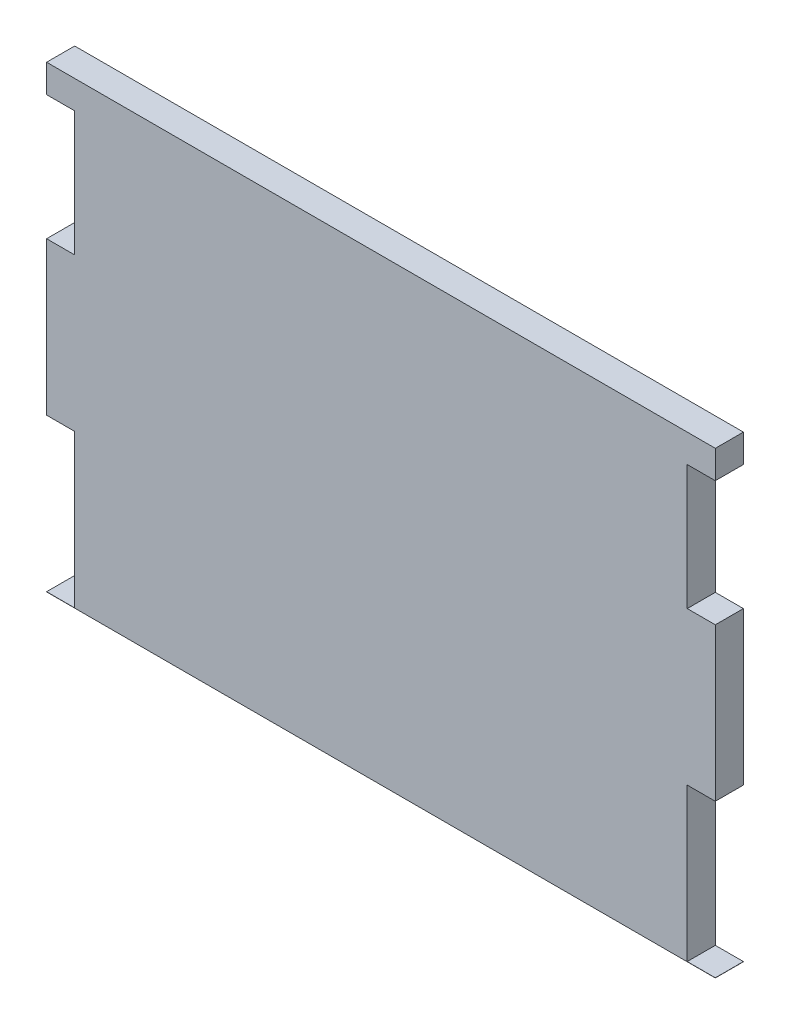
ISO-10303-21;
HEADER;
FILE_DESCRIPTION(('STEP AP214'),'2;1');
FILE_NAME('part.step','',(''),(''),'','','');
FILE_SCHEMA(('AUTOMOTIVE_DESIGN { 1 0 10303 214 1 1 1 1 }'));
ENDSEC;
DATA;
#1=APPLICATION_CONTEXT('core data for automotive mechanical design processes');
#2=APPLICATION_PROTOCOL_DEFINITION('international standard','automotive_design',2000,#1);
#3=PRODUCT_CONTEXT('',#1,'mechanical');
#4=PRODUCT('Part','Part','',(#3));
#5=PRODUCT_RELATED_PRODUCT_CATEGORY('part','',(#4));
#6=PRODUCT_DEFINITION_FORMATION('','',#4);
#7=PRODUCT_DEFINITION_CONTEXT('part definition',#1,'design');
#8=PRODUCT_DEFINITION('design','',#6,#7);
#9=PRODUCT_DEFINITION_SHAPE('','',#8);
#10=(LENGTH_UNIT() NAMED_UNIT(*) SI_UNIT(.MILLI.,.METRE.));
#11=(NAMED_UNIT(*) PLANE_ANGLE_UNIT() SI_UNIT($,.RADIAN.));
#12=(NAMED_UNIT(*) SI_UNIT($,.STERADIAN.) SOLID_ANGLE_UNIT());
#13=UNCERTAINTY_MEASURE_WITH_UNIT(LENGTH_MEASURE(1.E-05),#10,'distance_accuracy_value','');
#14=(GEOMETRIC_REPRESENTATION_CONTEXT(3) GLOBAL_UNCERTAINTY_ASSIGNED_CONTEXT((#13)) GLOBAL_UNIT_ASSIGNED_CONTEXT((#10,
#11,#12)) REPRESENTATION_CONTEXT('',''));
#15=CARTESIAN_POINT('',(0.,0.,0.));
#16=DIRECTION('',(0.,0.,1.));
#17=DIRECTION('',(1.,0.,0.));
#18=AXIS2_PLACEMENT_3D('',#15,#16,#17);
#19=CARTESIAN_POINT('',(63.5,76.2,5.334));
#20=DIRECTION('',(0.,0.,-1.));
#21=DIRECTION('',(-1.,0.,0.));
#22=AXIS2_PLACEMENT_3D('',#19,#20,#21);
#23=PLANE('',#22);
#24=DIRECTION('',(0.,1.,0.));
#25=VECTOR('',#24,1.);
#26=CARTESIAN_POINT('',(-58.166,76.2,5.334));
#27=LINE('',#26,#25);
#28=CARTESIAN_POINT('',(-58.166,-76.1637142857143,5.334));
#29=VERTEX_POINT('',#28);
#30=CARTESIAN_POINT('',(-58.166,-47.1351428571429,5.334));
#31=VERTEX_POINT('',#30);
#32=EDGE_CURVE('E504',#29,#31,#27,.T.);
#33=ORIENTED_EDGE('',*,*,#32,.F.);
#34=DIRECTION('',(1.,0.,0.));
#35=VECTOR('',#34,1.);
#36=CARTESIAN_POINT('',(-63.5,-76.1637142857143,5.334));
#37=LINE('',#36,#35);
#38=CARTESIAN_POINT('',(-63.5,-76.1637142857143,5.334));
#39=VERTEX_POINT('',#38);
#40=EDGE_CURVE('E522',#39,#29,#37,.T.);
#41=ORIENTED_EDGE('',*,*,#40,.F.);
#42=DIRECTION('',(0.,-1.,0.));
#43=VECTOR('',#42,1.);
#44=CARTESIAN_POINT('',(-63.5,-76.2,5.334));
#45=LINE('',#44,#43);
#46=CARTESIAN_POINT('',(-63.5,-76.2,5.334));
#47=VERTEX_POINT('',#46);
#48=EDGE_CURVE('E234',#39,#47,#45,.T.);
#49=ORIENTED_EDGE('',*,*,#48,.T.);
#50=DIRECTION('',(1.,0.,0.));
#51=VECTOR('',#50,1.);
#52=CARTESIAN_POINT('',(-63.5,-76.2,5.334));
#53=LINE('',#52,#51);
#54=CARTESIAN_POINT('',(63.5,-76.2,5.334));
#55=VERTEX_POINT('',#54);
#56=EDGE_CURVE('E237',#47,#55,#53,.T.);
#57=ORIENTED_EDGE('',*,*,#56,.T.);
#58=DIRECTION('',(0.,1.,0.));
#59=VECTOR('',#58,1.);
#60=CARTESIAN_POINT('',(63.5,-76.2,5.334));
#61=LINE('',#60,#59);
#62=CARTESIAN_POINT('',(63.5,-76.1637142857143,5.334));
#63=VERTEX_POINT('',#62);
#64=EDGE_CURVE('E231',#55,#63,#61,.T.);
#65=ORIENTED_EDGE('',*,*,#64,.T.);
#66=DIRECTION('',(-1.,0.,0.));
#67=VECTOR('',#66,1.);
#68=CARTESIAN_POINT('',(63.5,-76.1637142857143,5.334));
#69=LINE('',#68,#67);
#70=CARTESIAN_POINT('',(58.166,-76.1637142857143,5.334));
#71=VERTEX_POINT('',#70);
#72=EDGE_CURVE('E253',#63,#71,#69,.T.);
#73=ORIENTED_EDGE('',*,*,#72,.T.);
#74=DIRECTION('',(0.,-1.,0.));
#75=VECTOR('',#74,1.);
#76=CARTESIAN_POINT('',(58.1660000000001,76.2,5.334));
#77=LINE('',#76,#75);
#78=CARTESIAN_POINT('',(58.166,-47.1351428571429,5.334));
#79=VERTEX_POINT('',#78);
#80=EDGE_CURVE('E267',#79,#71,#77,.T.);
#81=ORIENTED_EDGE('',*,*,#80,.F.);
#82=DIRECTION('',(-1.,0.,0.));
#83=VECTOR('',#82,1.);
#84=CARTESIAN_POINT('',(63.5,-47.1351428571429,5.334));
#85=LINE('',#84,#83);
#86=CARTESIAN_POINT('',(63.5,-47.1351428571429,5.33399999999999));
#87=VERTEX_POINT('',#86);
#88=EDGE_CURVE('E293',#87,#79,#85,.T.);
#89=ORIENTED_EDGE('',*,*,#88,.F.);
#90=CARTESIAN_POINT('',(63.5,-18.1065714285714,5.334));
#91=VERTEX_POINT('',#90);
#92=EDGE_CURVE('E235',#87,#91,#61,.T.);
#93=ORIENTED_EDGE('',*,*,#92,.T.);
#94=DIRECTION('',(-1.,0.,0.));
#95=VECTOR('',#94,1.);
#96=CARTESIAN_POINT('',(63.5,-18.1065714285714,5.334));
#97=LINE('',#96,#95);
#98=CARTESIAN_POINT('',(58.166,-18.1065714285714,5.334));
#99=VERTEX_POINT('',#98);
#100=EDGE_CURVE('E282',#91,#99,#97,.T.);
#101=ORIENTED_EDGE('',*,*,#100,.T.);
#102=CARTESIAN_POINT('',(58.166,5.58800000000056,5.334));
#103=VERTEX_POINT('',#102);
#104=EDGE_CURVE('E268',#103,#99,#77,.T.);
#105=ORIENTED_EDGE('',*,*,#104,.F.);
#106=DIRECTION('',(-1.,0.,0.));
#107=VECTOR('',#106,1.);
#108=CARTESIAN_POINT('',(63.5,5.58800000000056,5.334));
#109=LINE('',#108,#107);
#110=CARTESIAN_POINT('',(63.5000000000001,5.58800000000056,5.334));
#111=VERTEX_POINT('',#110);
#112=EDGE_CURVE('E265',#111,#103,#109,.T.);
#113=ORIENTED_EDGE('',*,*,#112,.F.);
#114=CARTESIAN_POINT('',(63.5,10.922,5.334));
#115=VERTEX_POINT('',#114);
#116=EDGE_CURVE('E198',#111,#115,#61,.T.);
#117=ORIENTED_EDGE('',*,*,#116,.T.);
#118=DIRECTION('',(1.,0.,0.));
#119=VECTOR('',#118,1.);
#120=CARTESIAN_POINT('',(-63.5,10.922,5.334));
#121=LINE('',#120,#119);
#122=CARTESIAN_POINT('',(-63.5,10.922,5.334));
#123=VERTEX_POINT('',#122);
#124=EDGE_CURVE('E228',#123,#115,#121,.T.);
#125=ORIENTED_EDGE('',*,*,#124,.F.);
#126=CARTESIAN_POINT('',(-63.5,5.58800000000051,5.334));
#127=VERTEX_POINT('',#126);
#128=EDGE_CURVE('E236',#123,#127,#45,.T.);
#129=ORIENTED_EDGE('',*,*,#128,.T.);
#130=DIRECTION('',(-1.,0.,0.));
#131=VECTOR('',#130,1.);
#132=CARTESIAN_POINT('',(63.5,5.58800000000054,5.334));
#133=LINE('',#132,#131);
#134=CARTESIAN_POINT('',(-58.166,5.58800000000054,5.334));
#135=VERTEX_POINT('',#134);
#136=EDGE_CURVE('E56',#135,#127,#133,.T.);
#137=ORIENTED_EDGE('',*,*,#136,.F.);
#138=CARTESIAN_POINT('',(-58.166,-18.1065714285714,5.334));
#139=VERTEX_POINT('',#138);
#140=EDGE_CURVE('E528',#139,#135,#27,.T.);
#141=ORIENTED_EDGE('',*,*,#140,.F.);
#142=DIRECTION('',(1.,0.,0.));
#143=VECTOR('',#142,1.);
#144=CARTESIAN_POINT('',(-63.5,-18.1065714285714,5.334));
#145=LINE('',#144,#143);
#146=CARTESIAN_POINT('',(-63.5,-18.1065714285714,5.334));
#147=VERTEX_POINT('',#146);
#148=EDGE_CURVE('E508',#147,#139,#145,.T.);
#149=ORIENTED_EDGE('',*,*,#148,.F.);
#150=CARTESIAN_POINT('',(-63.5,-47.1351428571429,5.334));
#151=VERTEX_POINT('',#150);
#152=EDGE_CURVE('E238',#147,#151,#45,.T.);
#153=ORIENTED_EDGE('',*,*,#152,.T.);
#154=DIRECTION('',(1.,0.,0.));
#155=VECTOR('',#154,1.);
#156=CARTESIAN_POINT('',(-63.5,-47.1351428571429,5.334));
#157=LINE('',#156,#155);
#158=EDGE_CURVE('E48',#151,#31,#157,.T.);
#159=ORIENTED_EDGE('',*,*,#158,.T.);
#160=EDGE_LOOP('',(#33,#41,#49,#57,#65,#73,#81,#89,#93,#101,#105,#113,#117,#125,#129,#137,#141,
#149,#153,#159));
#161=FACE_BOUND('',#160,.T.);
#162=ADVANCED_FACE('F33',(#161),#23,.F.);
#163=CARTESIAN_POINT('',(63.5,76.2,0.));
#164=DIRECTION('',(0.,0.,-1.));
#165=DIRECTION('',(-1.,0.,0.));
#166=AXIS2_PLACEMENT_3D('',#163,#164,#165);
#167=PLANE('',#166);
#168=DIRECTION('',(0.,-1.,0.));
#169=VECTOR('',#168,1.);
#170=CARTESIAN_POINT('',(-63.5,-76.2,0.));
#171=LINE('',#170,#169);
#172=CARTESIAN_POINT('',(-63.5,-76.1637142857143,0.));
#173=VERTEX_POINT('',#172);
#174=CARTESIAN_POINT('',(-63.5,-76.2,0.));
#175=VERTEX_POINT('',#174);
#176=EDGE_CURVE('E197',#173,#175,#171,.T.);
#177=ORIENTED_EDGE('',*,*,#176,.F.);
#178=DIRECTION('',(1.,0.,0.));
#179=VECTOR('',#178,1.);
#180=CARTESIAN_POINT('',(-63.5,-76.1637142857143,0.));
#181=LINE('',#180,#179);
#182=CARTESIAN_POINT('',(-58.166,-76.1637142857143,0.));
#183=VERTEX_POINT('',#182);
#184=EDGE_CURVE('E520',#173,#183,#181,.T.);
#185=ORIENTED_EDGE('',*,*,#184,.T.);
#186=DIRECTION('',(0.,1.,0.));
#187=VECTOR('',#186,1.);
#188=CARTESIAN_POINT('',(-58.166,-134.220857142857,0.));
#189=LINE('',#188,#187);
#190=CARTESIAN_POINT('',(-58.166,-47.1351428571429,0.));
#191=VERTEX_POINT('',#190);
#192=EDGE_CURVE('E527',#183,#191,#189,.T.);
#193=ORIENTED_EDGE('',*,*,#192,.T.);
#194=DIRECTION('',(1.,0.,0.));
#195=VECTOR('',#194,1.);
#196=CARTESIAN_POINT('',(-63.5,-47.1351428571429,0.));
#197=LINE('',#196,#195);
#198=CARTESIAN_POINT('',(-63.5,-47.1351428571429,0.));
#199=VERTEX_POINT('',#198);
#200=EDGE_CURVE('E497',#199,#191,#197,.T.);
#201=ORIENTED_EDGE('',*,*,#200,.F.);
#202=CARTESIAN_POINT('',(-63.5,-18.1065714285715,0.));
#203=VERTEX_POINT('',#202);
#204=EDGE_CURVE('E195',#203,#199,#171,.T.);
#205=ORIENTED_EDGE('',*,*,#204,.F.);
#206=DIRECTION('',(1.,0.,0.));
#207=VECTOR('',#206,1.);
#208=CARTESIAN_POINT('',(-63.5,-18.1065714285715,0.));
#209=LINE('',#208,#207);
#210=CARTESIAN_POINT('',(-58.166,-18.1065714285715,0.));
#211=VERTEX_POINT('',#210);
#212=EDGE_CURVE('E513',#203,#211,#209,.T.);
#213=ORIENTED_EDGE('',*,*,#212,.T.);
#214=CARTESIAN_POINT('',(-58.166,5.58800000000054,1.11022302462516E-13));
#215=VERTEX_POINT('',#214);
#216=EDGE_CURVE('E189',#211,#215,#189,.T.);
#217=ORIENTED_EDGE('',*,*,#216,.T.);
#218=DIRECTION('',(-1.,0.,0.));
#219=VECTOR('',#218,1.);
#220=CARTESIAN_POINT('',(-63.5,5.58800000000054,1.11022302462516E-13));
#221=LINE('',#220,#219);
#222=CARTESIAN_POINT('',(-63.5,5.58800000000054,1.11022302462516E-13));
#223=VERTEX_POINT('',#222);
#224=EDGE_CURVE('E173',#215,#223,#221,.T.);
#225=ORIENTED_EDGE('',*,*,#224,.T.);
#226=CARTESIAN_POINT('',(-63.5,10.922,0.));
#227=VERTEX_POINT('',#226);
#228=EDGE_CURVE('E186',#227,#223,#171,.T.);
#229=ORIENTED_EDGE('',*,*,#228,.F.);
#230=DIRECTION('',(1.,0.,0.));
#231=VECTOR('',#230,1.);
#232=CARTESIAN_POINT('',(-63.5,10.922,0.));
#233=LINE('',#232,#231);
#234=CARTESIAN_POINT('',(63.5,10.922,0.));
#235=VERTEX_POINT('',#234);
#236=EDGE_CURVE('E225',#227,#235,#233,.T.);
#237=ORIENTED_EDGE('',*,*,#236,.T.);
#238=DIRECTION('',(0.,1.,0.));
#239=VECTOR('',#238,1.);
#240=CARTESIAN_POINT('',(63.5,-76.2,0.));
#241=LINE('',#240,#239);
#242=CARTESIAN_POINT('',(63.5000000000001,5.58800000000056,-1.31838984174237E-13));
#243=VERTEX_POINT('',#242);
#244=EDGE_CURVE('E208',#243,#235,#241,.T.);
#245=ORIENTED_EDGE('',*,*,#244,.F.);
#246=DIRECTION('',(-1.,0.,0.));
#247=VECTOR('',#246,1.);
#248=CARTESIAN_POINT('',(63.5000000000001,5.58800000000056,-1.31838984174237E-13));
#249=LINE('',#248,#247);
#250=CARTESIAN_POINT('',(58.166,5.58800000000056,0.));
#251=VERTEX_POINT('',#250);
#252=EDGE_CURVE('E532',#243,#251,#249,.T.);
#253=ORIENTED_EDGE('',*,*,#252,.T.);
#254=DIRECTION('',(0.,-1.,0.));
#255=VECTOR('',#254,1.);
#256=CARTESIAN_POINT('',(58.166,-134.220857142857,0.));
#257=LINE('',#256,#255);
#258=CARTESIAN_POINT('',(58.166,-18.1065714285714,0.));
#259=VERTEX_POINT('',#258);
#260=EDGE_CURVE('E255',#251,#259,#257,.T.);
#261=ORIENTED_EDGE('',*,*,#260,.T.);
#262=DIRECTION('',(-1.,0.,0.));
#263=VECTOR('',#262,1.);
#264=CARTESIAN_POINT('',(63.5,-18.1065714285714,0.));
#265=LINE('',#264,#263);
#266=CARTESIAN_POINT('',(63.5,-18.1065714285714,0.));
#267=VERTEX_POINT('',#266);
#268=EDGE_CURVE('E285',#267,#259,#265,.T.);
#269=ORIENTED_EDGE('',*,*,#268,.F.);
#270=CARTESIAN_POINT('',(63.5,-47.1351428571429,0.));
#271=VERTEX_POINT('',#270);
#272=EDGE_CURVE('E207',#271,#267,#241,.T.);
#273=ORIENTED_EDGE('',*,*,#272,.F.);
#274=DIRECTION('',(-1.,0.,0.));
#275=VECTOR('',#274,1.);
#276=CARTESIAN_POINT('',(63.5,-47.1351428571429,0.));
#277=LINE('',#276,#275);
#278=CARTESIAN_POINT('',(58.166,-47.1351428571428,0.));
#279=VERTEX_POINT('',#278);
#280=EDGE_CURVE('E296',#271,#279,#277,.T.);
#281=ORIENTED_EDGE('',*,*,#280,.T.);
#282=CARTESIAN_POINT('',(58.166,-76.1637142857143,0.));
#283=VERTEX_POINT('',#282);
#284=EDGE_CURVE('E250',#279,#283,#257,.T.);
#285=ORIENTED_EDGE('',*,*,#284,.T.);
#286=DIRECTION('',(-1.,0.,0.));
#287=VECTOR('',#286,1.);
#288=CARTESIAN_POINT('',(63.5,-76.1637142857143,0.));
#289=LINE('',#288,#287);
#290=CARTESIAN_POINT('',(63.5,-76.1637142857143,0.));
#291=VERTEX_POINT('',#290);
#292=EDGE_CURVE('E248',#291,#283,#289,.T.);
#293=ORIENTED_EDGE('',*,*,#292,.F.);
#294=CARTESIAN_POINT('',(63.5,-76.2,0.));
#295=VERTEX_POINT('',#294);
#296=EDGE_CURVE('E202',#295,#291,#241,.T.);
#297=ORIENTED_EDGE('',*,*,#296,.F.);
#298=DIRECTION('',(1.,0.,0.));
#299=VECTOR('',#298,1.);
#300=CARTESIAN_POINT('',(-63.5,-76.2,0.));
#301=LINE('',#300,#299);
#302=EDGE_CURVE('E194',#175,#295,#301,.T.);
#303=ORIENTED_EDGE('',*,*,#302,.F.);
#304=EDGE_LOOP('',(#177,#185,#193,#201,#205,#213,#217,#225,#229,#237,#245,#253,#261,#269,#273,
#281,#285,#293,#297,#303));
#305=FACE_BOUND('',#304,.T.);
#306=ADVANCED_FACE('F184',(#305),#167,.T.);
#307=CARTESIAN_POINT('',(-63.5,-76.2,5.334));
#308=DIRECTION('',(1.,0.,0.));
#309=DIRECTION('',(0.,0.,-1.));
#310=AXIS2_PLACEMENT_3D('',#307,#308,#309);
#311=PLANE('',#310);
#312=DIRECTION('',(0.,0.,1.));
#313=VECTOR('',#312,1.);
#314=CARTESIAN_POINT('',(-63.5,-76.1637142857143,0.));
#315=LINE('',#314,#313);
#316=EDGE_CURVE('E511',#173,#39,#315,.T.);
#317=ORIENTED_EDGE('',*,*,#316,.F.);
#318=ORIENTED_EDGE('',*,*,#176,.T.);
#319=DIRECTION('',(0.,0.,-1.));
#320=VECTOR('',#319,1.);
#321=CARTESIAN_POINT('',(-63.5,-76.2,5.334));
#322=LINE('',#321,#320);
#323=EDGE_CURVE('E11',#47,#175,#322,.T.);
#324=ORIENTED_EDGE('',*,*,#323,.F.);
#325=ORIENTED_EDGE('',*,*,#48,.F.);
#326=EDGE_LOOP('',(#317,#318,#324,#325));
#327=FACE_BOUND('',#326,.T.);
#328=ADVANCED_FACE('F332',(#327),#311,.F.);
#329=DIRECTION('',(0.,0.,-1.));
#330=VECTOR('',#329,1.);
#331=CARTESIAN_POINT('',(-63.5,-47.1351428571429,0.));
#332=LINE('',#331,#330);
#333=EDGE_CURVE('E541',#151,#199,#332,.T.);
#334=ORIENTED_EDGE('',*,*,#333,.F.);
#335=ORIENTED_EDGE('',*,*,#152,.F.);
#336=DIRECTION('',(0.,0.,1.));
#337=VECTOR('',#336,1.);
#338=CARTESIAN_POINT('',(-63.5,-18.1065714285715,0.));
#339=LINE('',#338,#337);
#340=EDGE_CURVE('E519',#203,#147,#339,.T.);
#341=ORIENTED_EDGE('',*,*,#340,.F.);
#342=ORIENTED_EDGE('',*,*,#204,.T.);
#343=EDGE_LOOP('',(#334,#335,#341,#342));
#344=FACE_BOUND('',#343,.T.);
#345=ADVANCED_FACE('F335',(#344),#311,.F.);
#346=DIRECTION('',(0.,0.,1.));
#347=VECTOR('',#346,1.);
#348=CARTESIAN_POINT('',(-63.5,5.58800000000054,114.3));
#349=LINE('',#348,#347);
#350=EDGE_CURVE('E170',#223,#127,#349,.T.);
#351=ORIENTED_EDGE('',*,*,#350,.T.);
#352=ORIENTED_EDGE('',*,*,#128,.F.);
#353=DIRECTION('',(0.,0.,1.));
#354=VECTOR('',#353,1.);
#355=CARTESIAN_POINT('',(-63.5,10.922,0.));
#356=LINE('',#355,#354);
#357=EDGE_CURVE('E193',#227,#123,#356,.T.);
#358=ORIENTED_EDGE('',*,*,#357,.F.);
#359=ORIENTED_EDGE('',*,*,#228,.T.);
#360=EDGE_LOOP('',(#351,#352,#358,#359));
#361=FACE_BOUND('',#360,.T.);
#362=ADVANCED_FACE('F192',(#361),#311,.F.);
#363=CARTESIAN_POINT('',(63.5,-76.2,5.334));
#364=DIRECTION('',(-1.,0.,0.));
#365=DIRECTION('',(0.,0.,1.));
#366=AXIS2_PLACEMENT_3D('',#363,#364,#365);
#367=PLANE('',#366);
#368=DIRECTION('',(0.,0.,-1.));
#369=VECTOR('',#368,1.);
#370=CARTESIAN_POINT('',(63.5,-76.1637142857143,0.));
#371=LINE('',#370,#369);
#372=EDGE_CURVE('E258',#63,#291,#371,.T.);
#373=ORIENTED_EDGE('',*,*,#372,.F.);
#374=ORIENTED_EDGE('',*,*,#64,.F.);
#375=DIRECTION('',(0.,0.,-1.));
#376=VECTOR('',#375,1.);
#377=CARTESIAN_POINT('',(63.5,-76.2,5.334));
#378=LINE('',#377,#376);
#379=EDGE_CURVE('E41',#55,#295,#378,.T.);
#380=ORIENTED_EDGE('',*,*,#379,.T.);
#381=ORIENTED_EDGE('',*,*,#296,.T.);
#382=EDGE_LOOP('',(#373,#374,#380,#381));
#383=FACE_BOUND('',#382,.T.);
#384=ADVANCED_FACE('F35',(#383),#367,.F.);
#385=DIRECTION('',(0.,0.,-1.));
#386=VECTOR('',#385,1.);
#387=CARTESIAN_POINT('',(63.5,-18.1065714285714,0.));
#388=LINE('',#387,#386);
#389=EDGE_CURVE('E299',#91,#267,#388,.T.);
#390=ORIENTED_EDGE('',*,*,#389,.F.);
#391=ORIENTED_EDGE('',*,*,#92,.F.);
#392=DIRECTION('',(0.,0.,1.));
#393=VECTOR('',#392,1.);
#394=CARTESIAN_POINT('',(63.5,-47.1351428571429,0.));
#395=LINE('',#394,#393);
#396=EDGE_CURVE('E286',#271,#87,#395,.T.);
#397=ORIENTED_EDGE('',*,*,#396,.F.);
#398=ORIENTED_EDGE('',*,*,#272,.T.);
#399=EDGE_LOOP('',(#390,#391,#397,#398));
#400=FACE_BOUND('',#399,.T.);
#401=ADVANCED_FACE('F309',(#400),#367,.F.);
#402=DIRECTION('',(0.,0.,-1.));
#403=VECTOR('',#402,1.);
#404=CARTESIAN_POINT('',(63.5000000000001,5.58800000000056,-1.31838984174237E-13));
#405=LINE('',#404,#403);
#406=EDGE_CURVE('E313',#111,#243,#405,.T.);
#407=ORIENTED_EDGE('',*,*,#406,.T.);
#408=ORIENTED_EDGE('',*,*,#244,.T.);
#409=DIRECTION('',(0.,0.,1.));
#410=VECTOR('',#409,1.);
#411=CARTESIAN_POINT('',(63.5,10.922,0.));
#412=LINE('',#411,#410);
#413=EDGE_CURVE('E220',#235,#115,#412,.T.);
#414=ORIENTED_EDGE('',*,*,#413,.T.);
#415=ORIENTED_EDGE('',*,*,#116,.F.);
#416=EDGE_LOOP('',(#407,#408,#414,#415));
#417=FACE_BOUND('',#416,.T.);
#418=ADVANCED_FACE('F312',(#417),#367,.F.);
#419=CARTESIAN_POINT('',(-63.5,-76.2,5.334));
#420=DIRECTION('',(0.,1.,0.));
#421=DIRECTION('',(0.,0.,1.));
#422=AXIS2_PLACEMENT_3D('',#419,#420,#421);
#423=PLANE('',#422);
#424=ORIENTED_EDGE('',*,*,#302,.T.);
#425=ORIENTED_EDGE('',*,*,#379,.F.);
#426=ORIENTED_EDGE('',*,*,#56,.F.);
#427=ORIENTED_EDGE('',*,*,#323,.T.);
#428=EDGE_LOOP('',(#424,#425,#426,#427));
#429=FACE_BOUND('',#428,.T.);
#430=ADVANCED_FACE('F316',(#429),#423,.F.);
#431=CARTESIAN_POINT('',(-63.5,10.922,0.));
#432=DIRECTION('',(0.,-1.,0.));
#433=DIRECTION('',(0.,0.,-1.));
#434=AXIS2_PLACEMENT_3D('',#431,#432,#433);
#435=PLANE('',#434);
#436=ORIENTED_EDGE('',*,*,#124,.T.);
#437=ORIENTED_EDGE('',*,*,#413,.F.);
#438=ORIENTED_EDGE('',*,*,#236,.F.);
#439=ORIENTED_EDGE('',*,*,#357,.T.);
#440=EDGE_LOOP('',(#436,#437,#438,#439));
#441=FACE_BOUND('',#440,.T.);
#442=ADVANCED_FACE('F314',(#441),#435,.F.);
#443=CARTESIAN_POINT('',(63.5,-18.1065714285714,0.));
#444=DIRECTION('',(0.,1.,0.));
#445=DIRECTION('',(0.,0.,-1.));
#446=AXIS2_PLACEMENT_3D('',#443,#444,#445);
#447=PLANE('',#446);
#448=DIRECTION('',(0.,0.,-1.));
#449=VECTOR('',#448,1.);
#450=CARTESIAN_POINT('',(58.166,-18.1065714285714,0.));
#451=LINE('',#450,#449);
#452=EDGE_CURVE('E274',#99,#259,#451,.T.);
#453=ORIENTED_EDGE('',*,*,#452,.F.);
#454=ORIENTED_EDGE('',*,*,#100,.F.);
#455=ORIENTED_EDGE('',*,*,#389,.T.);
#456=ORIENTED_EDGE('',*,*,#268,.T.);
#457=EDGE_LOOP('',(#453,#454,#455,#456));
#458=FACE_BOUND('',#457,.T.);
#459=ADVANCED_FACE('F281',(#458),#447,.T.);
#460=CARTESIAN_POINT('',(-63.5,5.58800000000056,114.3));
#461=DIRECTION('',(0.,-1.,0.));
#462=DIRECTION('',(0.,0.,1.));
#463=AXIS2_PLACEMENT_3D('',#460,#461,#462);
#464=PLANE('',#463);
#465=ORIENTED_EDGE('',*,*,#112,.T.);
#466=DIRECTION('',(0.,0.,-1.));
#467=VECTOR('',#466,1.);
#468=CARTESIAN_POINT('',(58.166,5.58800000000056,114.3));
#469=LINE('',#468,#467);
#470=EDGE_CURVE('E277',#103,#251,#469,.T.);
#471=ORIENTED_EDGE('',*,*,#470,.T.);
#472=ORIENTED_EDGE('',*,*,#252,.F.);
#473=ORIENTED_EDGE('',*,*,#406,.F.);
#474=EDGE_LOOP('',(#465,#471,#472,#473));
#475=FACE_BOUND('',#474,.T.);
#476=ADVANCED_FACE('F322',(#475),#464,.T.);
#477=CARTESIAN_POINT('',(58.166,68.9791428571429,114.3));
#478=DIRECTION('',(1.,0.,0.));
#479=DIRECTION('',(0.,0.,-1.));
#480=AXIS2_PLACEMENT_3D('',#477,#478,#479);
#481=PLANE('',#480);
#482=ORIENTED_EDGE('',*,*,#104,.T.);
#483=ORIENTED_EDGE('',*,*,#452,.T.);
#484=ORIENTED_EDGE('',*,*,#260,.F.);
#485=ORIENTED_EDGE('',*,*,#470,.F.);
#486=EDGE_LOOP('',(#482,#483,#484,#485));
#487=FACE_BOUND('',#486,.T.);
#488=ADVANCED_FACE('F273',(#487),#481,.T.);
#489=ORIENTED_EDGE('',*,*,#80,.T.);
#490=DIRECTION('',(0.,0.,-1.));
#491=VECTOR('',#490,1.);
#492=CARTESIAN_POINT('',(58.166,-76.1637142857143,0.));
#493=LINE('',#492,#491);
#494=EDGE_CURVE('E261',#71,#283,#493,.T.);
#495=ORIENTED_EDGE('',*,*,#494,.T.);
#496=ORIENTED_EDGE('',*,*,#284,.F.);
#497=DIRECTION('',(0.,0.,1.));
#498=VECTOR('',#497,1.);
#499=CARTESIAN_POINT('',(58.166,-47.1351428571429,0.));
#500=LINE('',#499,#498);
#501=EDGE_CURVE('E287',#279,#79,#500,.T.);
#502=ORIENTED_EDGE('',*,*,#501,.T.);
#503=EDGE_LOOP('',(#489,#495,#496,#502));
#504=FACE_BOUND('',#503,.T.);
#505=ADVANCED_FACE('F301',(#504),#481,.T.);
#506=CARTESIAN_POINT('',(63.5,-76.1637142857143,0.));
#507=DIRECTION('',(0.,1.,0.));
#508=DIRECTION('',(0.,0.,-1.));
#509=AXIS2_PLACEMENT_3D('',#506,#507,#508);
#510=PLANE('',#509);
#511=ORIENTED_EDGE('',*,*,#494,.F.);
#512=ORIENTED_EDGE('',*,*,#72,.F.);
#513=ORIENTED_EDGE('',*,*,#372,.T.);
#514=ORIENTED_EDGE('',*,*,#292,.T.);
#515=EDGE_LOOP('',(#511,#512,#513,#514));
#516=FACE_BOUND('',#515,.T.);
#517=ADVANCED_FACE('F305',(#516),#510,.T.);
#518=CARTESIAN_POINT('',(63.5,-47.1351428571429,0.));
#519=DIRECTION('',(0.,-1.,0.));
#520=DIRECTION('',(0.,0.,1.));
#521=AXIS2_PLACEMENT_3D('',#518,#519,#520);
#522=PLANE('',#521);
#523=ORIENTED_EDGE('',*,*,#501,.F.);
#524=ORIENTED_EDGE('',*,*,#280,.F.);
#525=ORIENTED_EDGE('',*,*,#396,.T.);
#526=ORIENTED_EDGE('',*,*,#88,.T.);
#527=EDGE_LOOP('',(#523,#524,#525,#526));
#528=FACE_BOUND('',#527,.T.);
#529=ADVANCED_FACE('F390',(#528),#522,.T.);
#530=CARTESIAN_POINT('',(63.5,5.58800000000054,1.11022302462516E-13));
#531=DIRECTION('',(0.,-1.,0.));
#532=DIRECTION('',(0.,0.,-1.));
#533=AXIS2_PLACEMENT_3D('',#530,#531,#532);
#534=PLANE('',#533);
#535=ORIENTED_EDGE('',*,*,#136,.T.);
#536=ORIENTED_EDGE('',*,*,#350,.F.);
#537=ORIENTED_EDGE('',*,*,#224,.F.);
#538=DIRECTION('',(0.,0.,1.));
#539=VECTOR('',#538,1.);
#540=CARTESIAN_POINT('',(-58.166,5.58800000000054,0.));
#541=LINE('',#540,#539);
#542=EDGE_CURVE('E179',#215,#135,#541,.T.);
#543=ORIENTED_EDGE('',*,*,#542,.T.);
#544=EDGE_LOOP('',(#535,#536,#537,#543));
#545=FACE_BOUND('',#544,.T.);
#546=ADVANCED_FACE('F172',(#545),#534,.T.);
#547=CARTESIAN_POINT('',(-63.5,-18.1065714285715,0.));
#548=DIRECTION('',(0.,1.,0.));
#549=DIRECTION('',(0.,0.,1.));
#550=AXIS2_PLACEMENT_3D('',#547,#548,#549);
#551=PLANE('',#550);
#552=DIRECTION('',(0.,0.,1.));
#553=VECTOR('',#552,1.);
#554=CARTESIAN_POINT('',(-58.166,-18.1065714285715,0.));
#555=LINE('',#554,#553);
#556=EDGE_CURVE('E500',#211,#139,#555,.T.);
#557=ORIENTED_EDGE('',*,*,#556,.F.);
#558=ORIENTED_EDGE('',*,*,#212,.F.);
#559=ORIENTED_EDGE('',*,*,#340,.T.);
#560=ORIENTED_EDGE('',*,*,#148,.T.);
#561=EDGE_LOOP('',(#557,#558,#559,#560));
#562=FACE_BOUND('',#561,.T.);
#563=ADVANCED_FACE('F405',(#562),#551,.T.);
#564=CARTESIAN_POINT('',(-58.166,68.9791428571428,0.));
#565=DIRECTION('',(-1.,0.,0.));
#566=DIRECTION('',(0.,0.,1.));
#567=AXIS2_PLACEMENT_3D('',#564,#565,#566);
#568=PLANE('',#567);
#569=ORIENTED_EDGE('',*,*,#140,.T.);
#570=ORIENTED_EDGE('',*,*,#542,.F.);
#571=ORIENTED_EDGE('',*,*,#216,.F.);
#572=ORIENTED_EDGE('',*,*,#556,.T.);
#573=EDGE_LOOP('',(#569,#570,#571,#572));
#574=FACE_BOUND('',#573,.T.);
#575=ADVANCED_FACE('F413',(#574),#568,.T.);
#576=ORIENTED_EDGE('',*,*,#32,.T.);
#577=DIRECTION('',(0.,0.,-1.));
#578=VECTOR('',#577,1.);
#579=CARTESIAN_POINT('',(-58.166,-47.1351428571429,0.));
#580=LINE('',#579,#578);
#581=EDGE_CURVE('E495',#31,#191,#580,.T.);
#582=ORIENTED_EDGE('',*,*,#581,.T.);
#583=ORIENTED_EDGE('',*,*,#192,.F.);
#584=DIRECTION('',(0.,0.,1.));
#585=VECTOR('',#584,1.);
#586=CARTESIAN_POINT('',(-58.166,-76.1637142857143,0.));
#587=LINE('',#586,#585);
#588=EDGE_CURVE('E507',#183,#29,#587,.T.);
#589=ORIENTED_EDGE('',*,*,#588,.T.);
#590=EDGE_LOOP('',(#576,#582,#583,#589));
#591=FACE_BOUND('',#590,.T.);
#592=ADVANCED_FACE('F421',(#591),#568,.T.);
#593=CARTESIAN_POINT('',(-63.5,-76.1637142857143,0.));
#594=DIRECTION('',(0.,1.,0.));
#595=DIRECTION('',(0.,0.,1.));
#596=AXIS2_PLACEMENT_3D('',#593,#594,#595);
#597=PLANE('',#596);
#598=ORIENTED_EDGE('',*,*,#588,.F.);
#599=ORIENTED_EDGE('',*,*,#184,.F.);
#600=ORIENTED_EDGE('',*,*,#316,.T.);
#601=ORIENTED_EDGE('',*,*,#40,.T.);
#602=EDGE_LOOP('',(#598,#599,#600,#601));
#603=FACE_BOUND('',#602,.T.);
#604=ADVANCED_FACE('F430',(#603),#597,.T.);
#605=CARTESIAN_POINT('',(-63.5,-47.1351428571429,0.));
#606=DIRECTION('',(0.,-1.,0.));
#607=DIRECTION('',(0.,0.,-1.));
#608=AXIS2_PLACEMENT_3D('',#605,#606,#607);
#609=PLANE('',#608);
#610=ORIENTED_EDGE('',*,*,#581,.F.);
#611=ORIENTED_EDGE('',*,*,#158,.F.);
#612=ORIENTED_EDGE('',*,*,#333,.T.);
#613=ORIENTED_EDGE('',*,*,#200,.T.);
#614=EDGE_LOOP('',(#610,#611,#612,#613));
#615=FACE_BOUND('',#614,.T.);
#616=ADVANCED_FACE('F438',(#615),#609,.T.);
#617=CLOSED_SHELL('',(#162,#306,#328,#345,#362,#384,#401,#418,#430,#442,#459,#476,#488,#505,
#517,#529,#546,#563,#575,#592,#604,#616));
#618=MANIFOLD_SOLID_BREP('B2',#617);
#619=ADVANCED_BREP_SHAPE_REPRESENTATION('',(#18,#618),#14);
#620=SHAPE_DEFINITION_REPRESENTATION(#9,#619);
ENDSEC;
END-ISO-10303-21;
